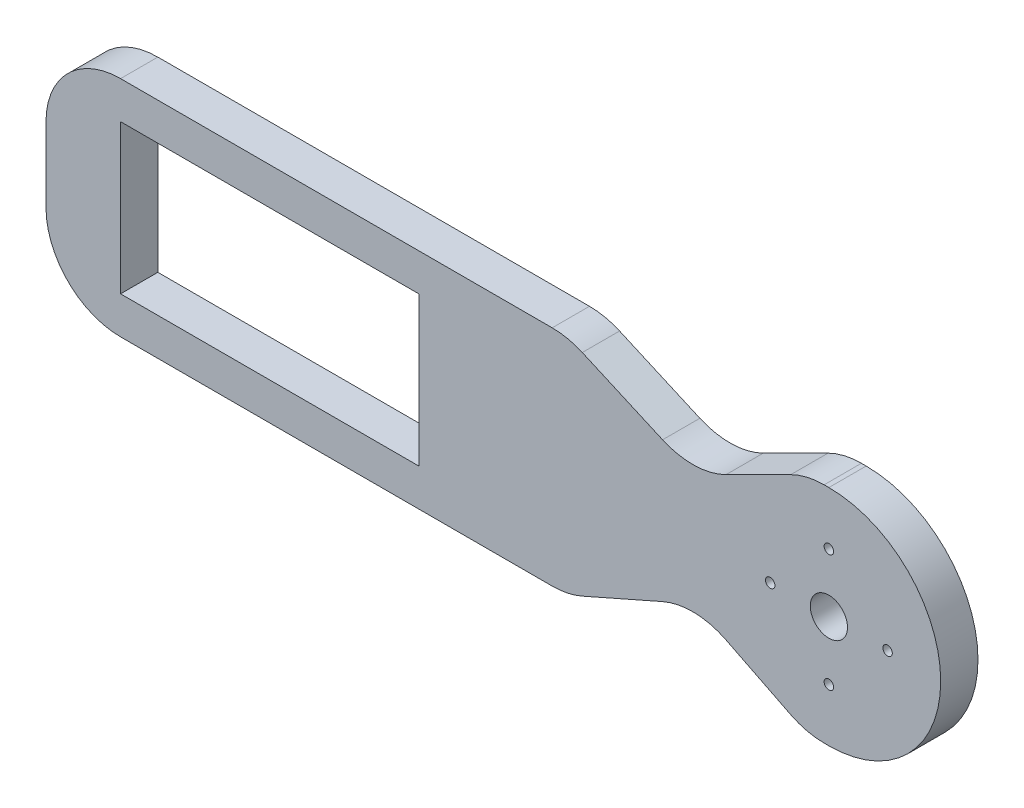
ISO-10303-21;
HEADER;
FILE_DESCRIPTION(('STEP AP214'),'2;1');
FILE_NAME('part.step','',(''),(''),'','','');
FILE_SCHEMA(('AUTOMOTIVE_DESIGN { 1 0 10303 214 1 1 1 1 }'));
ENDSEC;
DATA;
#1=APPLICATION_CONTEXT('core data for automotive mechanical design processes');
#2=APPLICATION_PROTOCOL_DEFINITION('international standard','automotive_design',2000,#1);
#3=PRODUCT_CONTEXT('',#1,'mechanical');
#4=PRODUCT('Part','Part','',(#3));
#5=PRODUCT_RELATED_PRODUCT_CATEGORY('part','',(#4));
#6=PRODUCT_DEFINITION_FORMATION('','',#4);
#7=PRODUCT_DEFINITION_CONTEXT('part definition',#1,'design');
#8=PRODUCT_DEFINITION('design','',#6,#7);
#9=PRODUCT_DEFINITION_SHAPE('','',#8);
#10=(LENGTH_UNIT() NAMED_UNIT(*) SI_UNIT(.MILLI.,.METRE.));
#11=(NAMED_UNIT(*) PLANE_ANGLE_UNIT() SI_UNIT($,.RADIAN.));
#12=(NAMED_UNIT(*) SI_UNIT($,.STERADIAN.) SOLID_ANGLE_UNIT());
#13=UNCERTAINTY_MEASURE_WITH_UNIT(LENGTH_MEASURE(1.E-05),#10,'distance_accuracy_value','');
#14=(GEOMETRIC_REPRESENTATION_CONTEXT(3) GLOBAL_UNCERTAINTY_ASSIGNED_CONTEXT((#13)) GLOBAL_UNIT_ASSIGNED_CONTEXT((#10,
#11,#12)) REPRESENTATION_CONTEXT('',''));
#15=CARTESIAN_POINT('',(0.,0.,0.));
#16=DIRECTION('',(0.,0.,1.));
#17=DIRECTION('',(1.,0.,0.));
#18=AXIS2_PLACEMENT_3D('',#15,#16,#17);
#19=CARTESIAN_POINT('',(-90.,9.9579435379429,5.));
#20=DIRECTION('',(0.,0.,1.));
#21=DIRECTION('',(1.,0.,0.));
#22=AXIS2_PLACEMENT_3D('',#19,#20,#21);
#23=CYLINDRICAL_SURFACE('',#22,10.);
#24=DIRECTION('',(0.,0.,1.));
#25=VECTOR('',#24,1.);
#26=CARTESIAN_POINT('',(-100.,9.9579435379429,5.));
#27=LINE('',#26,#25);
#28=CARTESIAN_POINT('',(-100.,9.9579435379429,0.));
#29=VERTEX_POINT('',#28);
#30=CARTESIAN_POINT('',(-100.,9.9579435379429,5.));
#31=VERTEX_POINT('',#30);
#32=EDGE_CURVE('E450',#29,#31,#27,.T.);
#33=ORIENTED_EDGE('',*,*,#32,.F.);
#34=CARTESIAN_POINT('',(-90.,9.9579435379429,0.));
#35=DIRECTION('',(0.,0.,1.));
#36=DIRECTION('',(1.,0.,0.));
#37=AXIS2_PLACEMENT_3D('',#34,#35,#36);
#38=CIRCLE('',#37,10.);
#39=CARTESIAN_POINT('',(-90.,-0.0420564620571007,0.));
#40=VERTEX_POINT('',#39);
#41=EDGE_CURVE('E47',#40,#29,#38,.F.);
#42=ORIENTED_EDGE('',*,*,#41,.F.);
#43=DIRECTION('',(0.,0.,1.));
#44=VECTOR('',#43,1.);
#45=CARTESIAN_POINT('',(-90.,-0.0420564620571007,5.));
#46=LINE('',#45,#44);
#47=CARTESIAN_POINT('',(-90.,-0.0420564620571007,5.));
#48=VERTEX_POINT('',#47);
#49=EDGE_CURVE('E454',#48,#40,#46,.F.);
#50=ORIENTED_EDGE('',*,*,#49,.F.);
#51=CARTESIAN_POINT('',(-90.,9.9579435379429,5.));
#52=DIRECTION('',(0.,0.,1.));
#53=DIRECTION('',(1.,0.,0.));
#54=AXIS2_PLACEMENT_3D('',#51,#52,#53);
#55=CIRCLE('',#54,10.);
#56=EDGE_CURVE('E11',#31,#48,#55,.T.);
#57=ORIENTED_EDGE('',*,*,#56,.F.);
#58=EDGE_LOOP('',(#33,#42,#50,#57));
#59=FACE_BOUND('',#58,.T.);
#60=ADVANCED_FACE('F39',(#59),#23,.T.);
#61=CARTESIAN_POINT('',(-90.,19.9579435379429,5.));
#62=DIRECTION('',(0.,0.,1.));
#63=DIRECTION('',(1.,0.,0.));
#64=AXIS2_PLACEMENT_3D('',#61,#62,#63);
#65=CYLINDRICAL_SURFACE('',#64,10.);
#66=DIRECTION('',(0.,0.,1.));
#67=VECTOR('',#66,1.);
#68=CARTESIAN_POINT('',(-90.,29.9579435379429,5.));
#69=LINE('',#68,#67);
#70=CARTESIAN_POINT('',(-90.,29.9579435379429,0.));
#71=VERTEX_POINT('',#70);
#72=CARTESIAN_POINT('',(-90.,29.9579435379429,5.));
#73=VERTEX_POINT('',#72);
#74=EDGE_CURVE('E436',#71,#73,#69,.T.);
#75=ORIENTED_EDGE('',*,*,#74,.F.);
#76=CARTESIAN_POINT('',(-90.,19.9579435379429,0.));
#77=DIRECTION('',(0.,0.,1.));
#78=DIRECTION('',(1.,0.,0.));
#79=AXIS2_PLACEMENT_3D('',#76,#77,#78);
#80=CIRCLE('',#79,10.);
#81=CARTESIAN_POINT('',(-100.,19.9579435379429,0.));
#82=VERTEX_POINT('',#81);
#83=EDGE_CURVE('E444',#82,#71,#80,.F.);
#84=ORIENTED_EDGE('',*,*,#83,.F.);
#85=DIRECTION('',(0.,0.,1.));
#86=VECTOR('',#85,1.);
#87=CARTESIAN_POINT('',(-100.,19.9579435379429,5.));
#88=LINE('',#87,#86);
#89=CARTESIAN_POINT('',(-100.,19.9579435379429,5.));
#90=VERTEX_POINT('',#89);
#91=EDGE_CURVE('E440',#90,#82,#88,.F.);
#92=ORIENTED_EDGE('',*,*,#91,.F.);
#93=CARTESIAN_POINT('',(-90.,19.9579435379429,5.));
#94=DIRECTION('',(0.,0.,1.));
#95=DIRECTION('',(1.,0.,0.));
#96=AXIS2_PLACEMENT_3D('',#93,#94,#95);
#97=CIRCLE('',#96,10.);
#98=EDGE_CURVE('E447',#73,#90,#97,.T.);
#99=ORIENTED_EDGE('',*,*,#98,.F.);
#100=EDGE_LOOP('',(#75,#84,#92,#99));
#101=FACE_BOUND('',#100,.T.);
#102=ADVANCED_FACE('F464',(#101),#65,.T.);
#103=CARTESIAN_POINT('',(4.99999999999999,-0.042056462057084,5.));
#104=DIRECTION('',(0.,1.,0.));
#105=DIRECTION('',(-1.,0.,0.));
#106=AXIS2_PLACEMENT_3D('',#103,#104,#105);
#107=PLANE('',#106);
#108=DIRECTION('',(1.,0.,0.));
#109=VECTOR('',#108,1.);
#110=CARTESIAN_POINT('',(4.99999999999999,-0.042056462057084,5.));
#111=LINE('',#110,#109);
#112=CARTESIAN_POINT('',(-32.1078722347494,-0.0420564620570905,5.));
#113=VERTEX_POINT('',#112);
#114=EDGE_CURVE('E403',#48,#113,#111,.T.);
#115=ORIENTED_EDGE('',*,*,#114,.F.);
#116=ORIENTED_EDGE('',*,*,#49,.T.);
#117=DIRECTION('',(1.,0.,0.));
#118=VECTOR('',#117,1.);
#119=CARTESIAN_POINT('',(4.99999999999999,-0.042056462057084,0.));
#120=LINE('',#119,#118);
#121=CARTESIAN_POINT('',(-32.1078722347494,-0.0420564620571035,0.));
#122=VERTEX_POINT('',#121);
#123=EDGE_CURVE('E419',#40,#122,#120,.T.);
#124=ORIENTED_EDGE('',*,*,#123,.T.);
#125=DIRECTION('',(0.,0.,1.));
#126=VECTOR('',#125,1.);
#127=CARTESIAN_POINT('',(-32.1078722347494,-0.0420564620571035,0.));
#128=LINE('',#127,#126);
#129=EDGE_CURVE('E306',#122,#113,#128,.T.);
#130=ORIENTED_EDGE('',*,*,#129,.T.);
#131=EDGE_LOOP('',(#115,#116,#124,#130));
#132=FACE_BOUND('',#131,.T.);
#133=ADVANCED_FACE('F516',(#132),#107,.F.);
#134=CARTESIAN_POINT('',(4.99999999999999,29.9579435379429,5.));
#135=DIRECTION('',(0.,-1.,0.));
#136=DIRECTION('',(1.,0.,0.));
#137=AXIS2_PLACEMENT_3D('',#134,#135,#136);
#138=PLANE('',#137);
#139=DIRECTION('',(0.,0.,1.));
#140=VECTOR('',#139,1.);
#141=CARTESIAN_POINT('',(4.36067977499791,29.9579435379429,0.));
#142=LINE('',#141,#140);
#143=CARTESIAN_POINT('',(4.36067977499791,29.9579435379429,0.));
#144=VERTEX_POINT('',#143);
#145=CARTESIAN_POINT('',(4.36067977499791,29.9579435379429,5.));
#146=VERTEX_POINT('',#145);
#147=EDGE_CURVE('E251',#144,#146,#142,.T.);
#148=ORIENTED_EDGE('',*,*,#147,.T.);
#149=DIRECTION('',(-1.,0.,0.));
#150=VECTOR('',#149,1.);
#151=CARTESIAN_POINT('',(4.99999999999999,29.9579435379429,5.));
#152=LINE('',#151,#150);
#153=CARTESIAN_POINT('',(4.99999999999999,29.9579435379429,5.));
#154=VERTEX_POINT('',#153);
#155=EDGE_CURVE('E410',#154,#146,#152,.T.);
#156=ORIENTED_EDGE('',*,*,#155,.F.);
#157=DIRECTION('',(0.,0.,-1.));
#158=VECTOR('',#157,1.);
#159=CARTESIAN_POINT('',(4.99999999999999,29.9579435379429,5.));
#160=LINE('',#159,#158);
#161=CARTESIAN_POINT('',(4.99999999999999,29.9579435379429,0.));
#162=VERTEX_POINT('',#161);
#163=EDGE_CURVE('E414',#154,#162,#160,.T.);
#164=ORIENTED_EDGE('',*,*,#163,.T.);
#165=DIRECTION('',(-1.,0.,0.));
#166=VECTOR('',#165,1.);
#167=CARTESIAN_POINT('',(4.99999999999999,29.9579435379429,0.));
#168=LINE('',#167,#166);
#169=EDGE_CURVE('E402',#162,#144,#168,.T.);
#170=ORIENTED_EDGE('',*,*,#169,.T.);
#171=EDGE_LOOP('',(#148,#156,#164,#170));
#172=FACE_BOUND('',#171,.T.);
#173=ADVANCED_FACE('F484',(#172),#138,.F.);
#174=CARTESIAN_POINT('',(4.99999999999999,14.9579435379429,5.));
#175=DIRECTION('',(0.,0.,1.));
#176=DIRECTION('',(1.,0.,0.));
#177=AXIS2_PLACEMENT_3D('',#174,#175,#176);
#178=PLANE('',#177);
#179=DIRECTION('',(0.,-1.,0.));
#180=VECTOR('',#179,1.);
#181=CARTESIAN_POINT('',(-100.,-0.0420564620571024,5.));
#182=LINE('',#181,#180);
#183=EDGE_CURVE('E398',#90,#31,#182,.T.);
#184=ORIENTED_EDGE('',*,*,#183,.T.);
#185=ORIENTED_EDGE('',*,*,#56,.T.);
#186=ORIENTED_EDGE('',*,*,#114,.T.);
#187=CARTESIAN_POINT('',(-32.1078722347494,9.9579435379429,5.));
#188=DIRECTION('',(0.,0.,-1.));
#189=DIRECTION('',(-1.,0.,0.));
#190=AXIS2_PLACEMENT_3D('',#187,#188,#189);
#191=CIRCLE('',#190,10.);
#192=CARTESIAN_POINT('',(-28.0714701689865,0.808765522213577,5.));
#193=VERTEX_POINT('',#192);
#194=EDGE_CURVE('E287',#193,#113,#191,.T.);
#195=ORIENTED_EDGE('',*,*,#194,.F.);
#196=DIRECTION('',(-0.914917801572932,-0.403640206576293,0.));
#197=VECTOR('',#196,1.);
#198=CARTESIAN_POINT('',(-28.0714701689865,0.808765522213579,5.));
#199=LINE('',#198,#197);
#200=CARTESIAN_POINT('',(-17.3024480861918,5.55980467638769,5.));
#201=VERTEX_POINT('',#200);
#202=EDGE_CURVE('E283',#201,#193,#199,.T.);
#203=ORIENTED_EDGE('',*,*,#202,.F.);
#204=CARTESIAN_POINT('',(-13.2660460204289,-3.58937333934163,5.));
#205=DIRECTION('',(0.,0.,1.));
#206=DIRECTION('',(1.,0.,0.));
#207=AXIS2_PLACEMENT_3D('',#204,#205,#206);
#208=CIRCLE('',#207,9.99999999999999);
#209=CARTESIAN_POINT('',(-8.79391006542929,5.35489857065753,5.));
#210=VERTEX_POINT('',#209);
#211=EDGE_CURVE('E279',#210,#201,#208,.T.);
#212=ORIENTED_EDGE('',*,*,#211,.F.);
#213=DIRECTION('',(-0.894427190999916,0.447213595499958,0.));
#214=VECTOR('',#213,1.);
#215=CARTESIAN_POINT('',(-8.79391006542929,5.35489857065753,5.));
#216=LINE('',#215,#214);
#217=CARTESIAN_POINT('',(-0.111456180001714,1.01367162794374,5.));
#218=VERTEX_POINT('',#217);
#219=EDGE_CURVE('E262',#218,#210,#216,.T.);
#220=ORIENTED_EDGE('',*,*,#219,.F.);
#221=CARTESIAN_POINT('',(4.36067977499787,9.9579435379429,5.));
#222=DIRECTION('',(0.,0.,-1.));
#223=DIRECTION('',(-1.,0.,0.));
#224=AXIS2_PLACEMENT_3D('',#221,#222,#223);
#225=CIRCLE('',#224,10.);
#226=CARTESIAN_POINT('',(4.36067977499792,-0.042056462057103,5.));
#227=VERTEX_POINT('',#226);
#228=EDGE_CURVE('E291',#227,#218,#225,.T.);
#229=ORIENTED_EDGE('',*,*,#228,.F.);
#230=CARTESIAN_POINT('',(4.99999999999999,-0.0420564620570805,5.));
#231=VERTEX_POINT('',#230);
#232=EDGE_CURVE('E401',#227,#231,#111,.T.);
#233=ORIENTED_EDGE('',*,*,#232,.T.);
#234=CARTESIAN_POINT('',(4.99999999999999,14.9579435379429,5.));
#235=DIRECTION('',(0.,0.,1.));
#236=DIRECTION('',(1.,0.,0.));
#237=AXIS2_PLACEMENT_3D('',#234,#235,#236);
#238=CIRCLE('',#237,15.);
#239=EDGE_CURVE('E406',#231,#154,#238,.T.);
#240=ORIENTED_EDGE('',*,*,#239,.T.);
#241=ORIENTED_EDGE('',*,*,#155,.T.);
#242=CARTESIAN_POINT('',(4.36067977499787,19.9579435379429,5.));
#243=DIRECTION('',(0.,0.,-1.));
#244=DIRECTION('',(1.,0.,0.));
#245=AXIS2_PLACEMENT_3D('',#242,#243,#244);
#246=CIRCLE('',#245,10.);
#247=CARTESIAN_POINT('',(-0.111456180001707,28.9022154479421,5.));
#248=VERTEX_POINT('',#247);
#249=EDGE_CURVE('E235',#248,#146,#246,.T.);
#250=ORIENTED_EDGE('',*,*,#249,.F.);
#251=DIRECTION('',(0.894427190999916,0.447213595499958,0.));
#252=VECTOR('',#251,1.);
#253=CARTESIAN_POINT('',(-8.79391006542929,24.5609885052283,5.));
#254=LINE('',#253,#252);
#255=CARTESIAN_POINT('',(-8.79391006542929,24.5609885052283,5.));
#256=VERTEX_POINT('',#255);
#257=EDGE_CURVE('E231',#256,#248,#254,.T.);
#258=ORIENTED_EDGE('',*,*,#257,.F.);
#259=CARTESIAN_POINT('',(-13.2660460204289,33.5052604152274,5.));
#260=DIRECTION('',(0.,0.,1.));
#261=DIRECTION('',(-1.,0.,0.));
#262=AXIS2_PLACEMENT_3D('',#259,#260,#261);
#263=CIRCLE('',#262,9.99999999999999);
#264=CARTESIAN_POINT('',(-17.3024480861918,24.3560823994981,5.));
#265=VERTEX_POINT('',#264);
#266=EDGE_CURVE('E192',#265,#256,#263,.T.);
#267=ORIENTED_EDGE('',*,*,#266,.F.);
#268=DIRECTION('',(0.914917801572932,-0.403640206576293,0.));
#269=VECTOR('',#268,1.);
#270=CARTESIAN_POINT('',(-28.0714701689865,29.1071215536722,5.));
#271=LINE('',#270,#269);
#272=CARTESIAN_POINT('',(-28.0714701689865,29.1071215536722,5.));
#273=VERTEX_POINT('',#272);
#274=EDGE_CURVE('E215',#273,#265,#271,.T.);
#275=ORIENTED_EDGE('',*,*,#274,.F.);
#276=CARTESIAN_POINT('',(-32.1078722347494,19.9579435379429,5.));
#277=DIRECTION('',(0.,0.,-1.));
#278=DIRECTION('',(1.,0.,0.));
#279=AXIS2_PLACEMENT_3D('',#276,#277,#278);
#280=CIRCLE('',#279,10.);
#281=CARTESIAN_POINT('',(-32.1078722347494,29.9579435379429,5.));
#282=VERTEX_POINT('',#281);
#283=EDGE_CURVE('E219',#282,#273,#280,.T.);
#284=ORIENTED_EDGE('',*,*,#283,.F.);
#285=EDGE_CURVE('E409',#282,#73,#152,.T.);
#286=ORIENTED_EDGE('',*,*,#285,.T.);
#287=ORIENTED_EDGE('',*,*,#98,.T.);
#288=EDGE_LOOP('',(#184,#185,#186,#195,#203,#212,#220,#229,#233,#240,#241,#250,#258,#267,#275,
#284,#286,#287));
#289=FACE_BOUND('',#288,.T.);
#290=CARTESIAN_POINT('',(12.8750033,14.9579435379429,5.));
#291=DIRECTION('',(0.,0.,1.));
#292=DIRECTION('',(1.,0.,0.));
#293=AXIS2_PLACEMENT_3D('',#290,#291,#292);
#294=CIRCLE('',#293,0.635000000000001);
#295=CARTESIAN_POINT('',(13.5100033,14.9579435379429,5.));
#296=VERTEX_POINT('',#295);
#297=EDGE_CURVE('E323',#296,#296,#294,.T.);
#298=ORIENTED_EDGE('',*,*,#297,.F.);
#299=EDGE_LOOP('',(#298));
#300=FACE_BOUND('',#299,.T.);
#301=DIRECTION('',(1.,0.,0.));
#302=VECTOR('',#301,1.);
#303=CARTESIAN_POINT('',(-90.,4.9579435379429,5.));
#304=LINE('',#303,#302);
#305=CARTESIAN_POINT('',(-90.,4.9579435379429,5.));
#306=VERTEX_POINT('',#305);
#307=CARTESIAN_POINT('',(-50.,4.9579435379429,5.));
#308=VERTEX_POINT('',#307);
#309=EDGE_CURVE('E342',#306,#308,#304,.T.);
#310=ORIENTED_EDGE('',*,*,#309,.F.);
#311=DIRECTION('',(0.,-1.,0.));
#312=VECTOR('',#311,1.);
#313=CARTESIAN_POINT('',(-90.,24.9579435379429,5.));
#314=LINE('',#313,#312);
#315=CARTESIAN_POINT('',(-90.,24.9579435379429,5.));
#316=VERTEX_POINT('',#315);
#317=EDGE_CURVE('E339',#316,#306,#314,.T.);
#318=ORIENTED_EDGE('',*,*,#317,.F.);
#319=DIRECTION('',(-1.,0.,0.));
#320=VECTOR('',#319,1.);
#321=CARTESIAN_POINT('',(-90.,24.9579435379429,5.));
#322=LINE('',#321,#320);
#323=CARTESIAN_POINT('',(-50.,24.9579435379429,5.));
#324=VERTEX_POINT('',#323);
#325=EDGE_CURVE('E350',#324,#316,#322,.T.);
#326=ORIENTED_EDGE('',*,*,#325,.F.);
#327=DIRECTION('',(0.,1.,0.));
#328=VECTOR('',#327,1.);
#329=CARTESIAN_POINT('',(-50.,24.9579435379429,5.));
#330=LINE('',#329,#328);
#331=EDGE_CURVE('E346',#308,#324,#330,.T.);
#332=ORIENTED_EDGE('',*,*,#331,.F.);
#333=EDGE_LOOP('',(#310,#318,#326,#332));
#334=FACE_BOUND('',#333,.T.);
#335=CARTESIAN_POINT('',(4.99999999999999,22.8329468379429,5.));
#336=DIRECTION('',(0.,0.,1.));
#337=DIRECTION('',(1.,0.,0.));
#338=AXIS2_PLACEMENT_3D('',#335,#336,#337);
#339=CIRCLE('',#338,0.635);
#340=CARTESIAN_POINT('',(5.63499999999999,22.8329468379429,5.));
#341=VERTEX_POINT('',#340);
#342=EDGE_CURVE('E382',#341,#341,#339,.T.);
#343=ORIENTED_EDGE('',*,*,#342,.F.);
#344=EDGE_LOOP('',(#343));
#345=FACE_BOUND('',#344,.T.);
#346=CARTESIAN_POINT('',(4.99999999999999,14.9579435379429,5.));
#347=DIRECTION('',(0.,0.,1.));
#348=DIRECTION('',(1.,0.,0.));
#349=AXIS2_PLACEMENT_3D('',#346,#347,#348);
#350=CIRCLE('',#349,2.5);
#351=CARTESIAN_POINT('',(7.49999999999999,14.9579435379429,5.));
#352=VERTEX_POINT('',#351);
#353=EDGE_CURVE('E390',#352,#352,#350,.T.);
#354=ORIENTED_EDGE('',*,*,#353,.F.);
#355=EDGE_LOOP('',(#354));
#356=FACE_BOUND('',#355,.T.);
#357=CARTESIAN_POINT('',(-2.87500330000001,14.9579435379429,5.));
#358=DIRECTION('',(0.,0.,1.));
#359=DIRECTION('',(1.,0.,0.));
#360=AXIS2_PLACEMENT_3D('',#357,#358,#359);
#361=CIRCLE('',#360,0.634999999999999);
#362=CARTESIAN_POINT('',(-2.24000330000001,14.9579435379429,5.));
#363=VERTEX_POINT('',#362);
#364=EDGE_CURVE('E331',#363,#363,#361,.T.);
#365=ORIENTED_EDGE('',*,*,#364,.F.);
#366=EDGE_LOOP('',(#365));
#367=FACE_BOUND('',#366,.T.);
#368=CARTESIAN_POINT('',(4.99999999999999,7.08294023794292,5.));
#369=DIRECTION('',(0.,0.,1.));
#370=DIRECTION('',(1.,0.,0.));
#371=AXIS2_PLACEMENT_3D('',#368,#369,#370);
#372=CIRCLE('',#371,0.635000000000001);
#373=CARTESIAN_POINT('',(5.63499999999999,7.08294023794292,5.));
#374=VERTEX_POINT('',#373);
#375=EDGE_CURVE('E315',#374,#374,#372,.T.);
#376=ORIENTED_EDGE('',*,*,#375,.F.);
#377=EDGE_LOOP('',(#376));
#378=FACE_BOUND('',#377,.T.);
#379=ADVANCED_FACE('F487',(#289,#300,#334,#345,#356,#367,#378),#178,.T.);
#380=CARTESIAN_POINT('',(4.99999999999999,14.9579435379429,0.));
#381=DIRECTION('',(0.,0.,1.));
#382=DIRECTION('',(1.,0.,0.));
#383=AXIS2_PLACEMENT_3D('',#380,#381,#382);
#384=PLANE('',#383);
#385=ORIENTED_EDGE('',*,*,#123,.F.);
#386=ORIENTED_EDGE('',*,*,#41,.T.);
#387=DIRECTION('',(0.,-1.,0.));
#388=VECTOR('',#387,1.);
#389=CARTESIAN_POINT('',(-100.,-0.0420564620571024,0.));
#390=LINE('',#389,#388);
#391=EDGE_CURVE('E394',#82,#29,#390,.T.);
#392=ORIENTED_EDGE('',*,*,#391,.F.);
#393=ORIENTED_EDGE('',*,*,#83,.T.);
#394=CARTESIAN_POINT('',(-32.1078722347494,29.9579435379429,0.));
#395=VERTEX_POINT('',#394);
#396=EDGE_CURVE('E425',#395,#71,#168,.T.);
#397=ORIENTED_EDGE('',*,*,#396,.F.);
#398=CARTESIAN_POINT('',(-32.1078722347494,19.9579435379429,0.));
#399=DIRECTION('',(0.,0.,-1.));
#400=DIRECTION('',(1.,0.,0.));
#401=AXIS2_PLACEMENT_3D('',#398,#399,#400);
#402=CIRCLE('',#401,10.);
#403=CARTESIAN_POINT('',(-28.0714701689865,29.1071215536722,0.));
#404=VERTEX_POINT('',#403);
#405=EDGE_CURVE('E224',#395,#404,#402,.T.);
#406=ORIENTED_EDGE('',*,*,#405,.T.);
#407=DIRECTION('',(0.914917801572932,-0.403640206576293,0.));
#408=VECTOR('',#407,1.);
#409=CARTESIAN_POINT('',(-28.0714701689865,29.1071215536722,0.));
#410=LINE('',#409,#408);
#411=CARTESIAN_POINT('',(-17.3024480861918,24.3560823994981,0.));
#412=VERTEX_POINT('',#411);
#413=EDGE_CURVE('E198',#404,#412,#410,.T.);
#414=ORIENTED_EDGE('',*,*,#413,.T.);
#415=CARTESIAN_POINT('',(-13.2660460204289,33.5052604152274,0.));
#416=DIRECTION('',(0.,0.,1.));
#417=DIRECTION('',(-1.,0.,0.));
#418=AXIS2_PLACEMENT_3D('',#415,#416,#417);
#419=CIRCLE('',#418,9.99999999999999);
#420=CARTESIAN_POINT('',(-8.79391006542929,24.5609885052283,0.));
#421=VERTEX_POINT('',#420);
#422=EDGE_CURVE('E189',#412,#421,#419,.T.);
#423=ORIENTED_EDGE('',*,*,#422,.T.);
#424=DIRECTION('',(0.894427190999916,0.447213595499958,0.));
#425=VECTOR('',#424,1.);
#426=CARTESIAN_POINT('',(-8.79391006542929,24.5609885052283,0.));
#427=LINE('',#426,#425);
#428=CARTESIAN_POINT('',(-0.111456180001707,28.9022154479421,0.));
#429=VERTEX_POINT('',#428);
#430=EDGE_CURVE('E201',#421,#429,#427,.T.);
#431=ORIENTED_EDGE('',*,*,#430,.T.);
#432=CARTESIAN_POINT('',(4.36067977499787,19.9579435379429,0.));
#433=DIRECTION('',(0.,0.,-1.));
#434=DIRECTION('',(1.,0.,0.));
#435=AXIS2_PLACEMENT_3D('',#432,#433,#434);
#436=CIRCLE('',#435,10.);
#437=EDGE_CURVE('E207',#429,#144,#436,.T.);
#438=ORIENTED_EDGE('',*,*,#437,.T.);
#439=ORIENTED_EDGE('',*,*,#169,.F.);
#440=CARTESIAN_POINT('',(4.99999999999999,14.9579435379429,0.));
#441=DIRECTION('',(0.,0.,1.));
#442=DIRECTION('',(1.,0.,0.));
#443=AXIS2_PLACEMENT_3D('',#440,#441,#442);
#444=CIRCLE('',#443,15.);
#445=CARTESIAN_POINT('',(4.99999999999999,-0.0420564620570805,0.));
#446=VERTEX_POINT('',#445);
#447=EDGE_CURVE('E422',#446,#162,#444,.T.);
#448=ORIENTED_EDGE('',*,*,#447,.F.);
#449=CARTESIAN_POINT('',(4.36067977499792,-0.042056462057103,0.));
#450=VERTEX_POINT('',#449);
#451=EDGE_CURVE('E418',#450,#446,#120,.T.);
#452=ORIENTED_EDGE('',*,*,#451,.F.);
#453=CARTESIAN_POINT('',(4.36067977499787,9.9579435379429,0.));
#454=DIRECTION('',(0.,0.,-1.));
#455=DIRECTION('',(-1.,0.,0.));
#456=AXIS2_PLACEMENT_3D('',#453,#454,#455);
#457=CIRCLE('',#456,10.);
#458=CARTESIAN_POINT('',(-0.111456180001714,1.01367162794374,0.));
#459=VERTEX_POINT('',#458);
#460=EDGE_CURVE('E270',#450,#459,#457,.T.);
#461=ORIENTED_EDGE('',*,*,#460,.T.);
#462=DIRECTION('',(-0.894427190999916,0.447213595499958,0.));
#463=VECTOR('',#462,1.);
#464=CARTESIAN_POINT('',(-8.79391006542929,5.35489857065753,0.));
#465=LINE('',#464,#463);
#466=CARTESIAN_POINT('',(-8.79391006542929,5.35489857065753,0.));
#467=VERTEX_POINT('',#466);
#468=EDGE_CURVE('E274',#459,#467,#465,.T.);
#469=ORIENTED_EDGE('',*,*,#468,.T.);
#470=CARTESIAN_POINT('',(-13.2660460204289,-3.58937333934163,0.));
#471=DIRECTION('',(0.,0.,1.));
#472=DIRECTION('',(1.,0.,0.));
#473=AXIS2_PLACEMENT_3D('',#470,#471,#472);
#474=CIRCLE('',#473,9.99999999999999);
#475=CARTESIAN_POINT('',(-17.3024480861918,5.55980467638769,0.));
#476=VERTEX_POINT('',#475);
#477=EDGE_CURVE('E257',#467,#476,#474,.T.);
#478=ORIENTED_EDGE('',*,*,#477,.T.);
#479=DIRECTION('',(-0.914917801572932,-0.403640206576293,0.));
#480=VECTOR('',#479,1.);
#481=CARTESIAN_POINT('',(-28.0714701689865,0.808765522213579,0.));
#482=LINE('',#481,#480);
#483=CARTESIAN_POINT('',(-28.0714701689865,0.808765522213577,0.));
#484=VERTEX_POINT('',#483);
#485=EDGE_CURVE('E261',#476,#484,#482,.T.);
#486=ORIENTED_EDGE('',*,*,#485,.T.);
#487=CARTESIAN_POINT('',(-32.1078722347494,9.9579435379429,0.));
#488=DIRECTION('',(0.,0.,-1.));
#489=DIRECTION('',(-1.,0.,0.));
#490=AXIS2_PLACEMENT_3D('',#487,#488,#489);
#491=CIRCLE('',#490,10.);
#492=EDGE_CURVE('E266',#484,#122,#491,.T.);
#493=ORIENTED_EDGE('',*,*,#492,.T.);
#494=EDGE_LOOP('',(#385,#386,#392,#393,#397,#406,#414,#423,#431,#438,#439,#448,#452,#461,#469,
#478,#486,#493));
#495=FACE_BOUND('',#494,.T.);
#496=CARTESIAN_POINT('',(4.99999999999999,22.8329468379429,0.));
#497=DIRECTION('',(0.,0.,1.));
#498=DIRECTION('',(1.,0.,0.));
#499=AXIS2_PLACEMENT_3D('',#496,#497,#498);
#500=CIRCLE('',#499,0.635);
#501=CARTESIAN_POINT('',(5.63499999999999,22.8329468379429,0.));
#502=VERTEX_POINT('',#501);
#503=EDGE_CURVE('E381',#502,#502,#500,.T.);
#504=ORIENTED_EDGE('',*,*,#503,.T.);
#505=EDGE_LOOP('',(#504));
#506=FACE_BOUND('',#505,.T.);
#507=CARTESIAN_POINT('',(4.99999999999999,14.9579435379429,0.));
#508=DIRECTION('',(0.,0.,1.));
#509=DIRECTION('',(1.,0.,0.));
#510=AXIS2_PLACEMENT_3D('',#507,#508,#509);
#511=CIRCLE('',#510,2.5);
#512=CARTESIAN_POINT('',(7.49999999999999,14.9579435379429,0.));
#513=VERTEX_POINT('',#512);
#514=EDGE_CURVE('E386',#513,#513,#511,.T.);
#515=ORIENTED_EDGE('',*,*,#514,.T.);
#516=EDGE_LOOP('',(#515));
#517=FACE_BOUND('',#516,.T.);
#518=DIRECTION('',(0.,-1.,0.));
#519=VECTOR('',#518,1.);
#520=CARTESIAN_POINT('',(-90.,24.9579435379429,0.));
#521=LINE('',#520,#519);
#522=CARTESIAN_POINT('',(-90.,24.9579435379429,0.));
#523=VERTEX_POINT('',#522);
#524=CARTESIAN_POINT('',(-90.,4.9579435379429,0.));
#525=VERTEX_POINT('',#524);
#526=EDGE_CURVE('E335',#523,#525,#521,.T.);
#527=ORIENTED_EDGE('',*,*,#526,.T.);
#528=DIRECTION('',(1.,0.,0.));
#529=VECTOR('',#528,1.);
#530=CARTESIAN_POINT('',(-90.,4.9579435379429,0.));
#531=LINE('',#530,#529);
#532=CARTESIAN_POINT('',(-50.,4.9579435379429,0.));
#533=VERTEX_POINT('',#532);
#534=EDGE_CURVE('E357',#525,#533,#531,.T.);
#535=ORIENTED_EDGE('',*,*,#534,.T.);
#536=DIRECTION('',(0.,1.,0.));
#537=VECTOR('',#536,1.);
#538=CARTESIAN_POINT('',(-50.,24.9579435379429,0.));
#539=LINE('',#538,#537);
#540=CARTESIAN_POINT('',(-50.,24.9579435379429,0.));
#541=VERTEX_POINT('',#540);
#542=EDGE_CURVE('E361',#533,#541,#539,.T.);
#543=ORIENTED_EDGE('',*,*,#542,.T.);
#544=DIRECTION('',(-1.,0.,0.));
#545=VECTOR('',#544,1.);
#546=CARTESIAN_POINT('',(-90.,24.9579435379429,0.));
#547=LINE('',#546,#545);
#548=EDGE_CURVE('E343',#541,#523,#547,.T.);
#549=ORIENTED_EDGE('',*,*,#548,.T.);
#550=EDGE_LOOP('',(#527,#535,#543,#549));
#551=FACE_BOUND('',#550,.T.);
#552=CARTESIAN_POINT('',(-2.87500330000001,14.9579435379429,0.));
#553=DIRECTION('',(0.,0.,1.));
#554=DIRECTION('',(1.,0.,0.));
#555=AXIS2_PLACEMENT_3D('',#552,#553,#554);
#556=CIRCLE('',#555,0.634999999999999);
#557=CARTESIAN_POINT('',(-2.24000330000001,14.9579435379429,0.));
#558=VERTEX_POINT('',#557);
#559=EDGE_CURVE('E327',#558,#558,#556,.T.);
#560=ORIENTED_EDGE('',*,*,#559,.T.);
#561=EDGE_LOOP('',(#560));
#562=FACE_BOUND('',#561,.T.);
#563=CARTESIAN_POINT('',(12.8750033,14.9579435379429,0.));
#564=DIRECTION('',(0.,0.,1.));
#565=DIRECTION('',(1.,0.,0.));
#566=AXIS2_PLACEMENT_3D('',#563,#564,#565);
#567=CIRCLE('',#566,0.635000000000001);
#568=CARTESIAN_POINT('',(13.5100033,14.9579435379429,0.));
#569=VERTEX_POINT('',#568);
#570=EDGE_CURVE('E319',#569,#569,#567,.T.);
#571=ORIENTED_EDGE('',*,*,#570,.T.);
#572=EDGE_LOOP('',(#571));
#573=FACE_BOUND('',#572,.T.);
#574=CARTESIAN_POINT('',(4.99999999999999,7.08294023794292,0.));
#575=DIRECTION('',(0.,0.,1.));
#576=DIRECTION('',(1.,0.,0.));
#577=AXIS2_PLACEMENT_3D('',#574,#575,#576);
#578=CIRCLE('',#577,0.635000000000001);
#579=CARTESIAN_POINT('',(5.63499999999999,7.08294023794292,0.));
#580=VERTEX_POINT('',#579);
#581=EDGE_CURVE('E244',#580,#580,#578,.T.);
#582=ORIENTED_EDGE('',*,*,#581,.T.);
#583=EDGE_LOOP('',(#582));
#584=FACE_BOUND('',#583,.T.);
#585=ADVANCED_FACE('F210',(#495,#506,#517,#551,#562,#573,#584),#384,.F.);
#586=CARTESIAN_POINT('',(-100.,-0.0420564620571024,5.));
#587=DIRECTION('',(1.,0.,0.));
#588=DIRECTION('',(0.,0.,-1.));
#589=AXIS2_PLACEMENT_3D('',#586,#587,#588);
#590=PLANE('',#589);
#591=ORIENTED_EDGE('',*,*,#391,.T.);
#592=ORIENTED_EDGE('',*,*,#32,.T.);
#593=ORIENTED_EDGE('',*,*,#183,.F.);
#594=ORIENTED_EDGE('',*,*,#91,.T.);
#595=EDGE_LOOP('',(#591,#592,#593,#594));
#596=FACE_BOUND('',#595,.T.);
#597=ADVANCED_FACE('F460',(#596),#590,.F.);
#598=ORIENTED_EDGE('',*,*,#232,.F.);
#599=DIRECTION('',(0.,0.,1.));
#600=VECTOR('',#599,1.);
#601=CARTESIAN_POINT('',(4.36067977499792,-0.042056462057103,0.));
#602=LINE('',#601,#600);
#603=EDGE_CURVE('E303',#450,#227,#602,.T.);
#604=ORIENTED_EDGE('',*,*,#603,.F.);
#605=ORIENTED_EDGE('',*,*,#451,.T.);
#606=DIRECTION('',(0.,0.,-1.));
#607=VECTOR('',#606,1.);
#608=CARTESIAN_POINT('',(4.99999999999999,-0.0420564620570805,5.));
#609=LINE('',#608,#607);
#610=EDGE_CURVE('E432',#231,#446,#609,.T.);
#611=ORIENTED_EDGE('',*,*,#610,.F.);
#612=EDGE_LOOP('',(#598,#604,#605,#611));
#613=FACE_BOUND('',#612,.T.);
#614=ADVANCED_FACE('F476',(#613),#107,.F.);
#615=CARTESIAN_POINT('',(4.99999999999999,14.9579435379429,5.));
#616=DIRECTION('',(0.,0.,-1.));
#617=DIRECTION('',(-1.,0.,0.));
#618=AXIS2_PLACEMENT_3D('',#615,#616,#617);
#619=CYLINDRICAL_SURFACE('',#618,15.);
#620=ORIENTED_EDGE('',*,*,#447,.T.);
#621=ORIENTED_EDGE('',*,*,#163,.F.);
#622=ORIENTED_EDGE('',*,*,#239,.F.);
#623=ORIENTED_EDGE('',*,*,#610,.T.);
#624=EDGE_LOOP('',(#620,#621,#622,#623));
#625=FACE_BOUND('',#624,.T.);
#626=ADVANCED_FACE('F480',(#625),#619,.T.);
#627=ORIENTED_EDGE('',*,*,#396,.T.);
#628=ORIENTED_EDGE('',*,*,#74,.T.);
#629=ORIENTED_EDGE('',*,*,#285,.F.);
#630=DIRECTION('',(0.,0.,1.));
#631=VECTOR('',#630,1.);
#632=CARTESIAN_POINT('',(-32.1078722347494,29.9579435379429,0.));
#633=LINE('',#632,#631);
#634=EDGE_CURVE('E248',#395,#282,#633,.T.);
#635=ORIENTED_EDGE('',*,*,#634,.F.);
#636=EDGE_LOOP('',(#627,#628,#629,#635));
#637=FACE_BOUND('',#636,.T.);
#638=ADVANCED_FACE('F497',(#637),#138,.F.);
#639=CARTESIAN_POINT('',(4.99999999999999,14.9579435379429,5.));
#640=DIRECTION('',(0.,0.,-1.));
#641=DIRECTION('',(-1.,0.,0.));
#642=AXIS2_PLACEMENT_3D('',#639,#640,#641);
#643=CYLINDRICAL_SURFACE('',#642,2.5);
#644=ORIENTED_EDGE('',*,*,#353,.T.);
#645=EDGE_LOOP('',(#644));
#646=FACE_BOUND('',#645,.T.);
#647=ORIENTED_EDGE('',*,*,#514,.F.);
#648=EDGE_LOOP('',(#647));
#649=FACE_BOUND('',#648,.T.);
#650=ADVANCED_FACE('F530',(#646,#649),#643,.F.);
#651=CARTESIAN_POINT('',(4.99999999999999,22.8329468379429,5.));
#652=DIRECTION('',(0.,0.,-1.));
#653=DIRECTION('',(-1.,0.,0.));
#654=AXIS2_PLACEMENT_3D('',#651,#652,#653);
#655=CYLINDRICAL_SURFACE('',#654,0.635);
#656=ORIENTED_EDGE('',*,*,#342,.T.);
#657=EDGE_LOOP('',(#656));
#658=FACE_BOUND('',#657,.T.);
#659=ORIENTED_EDGE('',*,*,#503,.F.);
#660=EDGE_LOOP('',(#659));
#661=FACE_BOUND('',#660,.T.);
#662=ADVANCED_FACE('F537',(#658,#661),#655,.F.);
#663=CARTESIAN_POINT('',(-90.,24.9579435379429,5.));
#664=DIRECTION('',(1.,0.,0.));
#665=DIRECTION('',(0.,0.,-1.));
#666=AXIS2_PLACEMENT_3D('',#663,#664,#665);
#667=PLANE('',#666);
#668=ORIENTED_EDGE('',*,*,#526,.F.);
#669=DIRECTION('',(0.,0.,-1.));
#670=VECTOR('',#669,1.);
#671=CARTESIAN_POINT('',(-90.,24.9579435379429,5.));
#672=LINE('',#671,#670);
#673=EDGE_CURVE('E353',#316,#523,#672,.T.);
#674=ORIENTED_EDGE('',*,*,#673,.F.);
#675=ORIENTED_EDGE('',*,*,#317,.T.);
#676=DIRECTION('',(0.,0.,-1.));
#677=VECTOR('',#676,1.);
#678=CARTESIAN_POINT('',(-90.,4.9579435379429,5.));
#679=LINE('',#678,#677);
#680=EDGE_CURVE('E377',#306,#525,#679,.T.);
#681=ORIENTED_EDGE('',*,*,#680,.T.);
#682=EDGE_LOOP('',(#668,#674,#675,#681));
#683=FACE_BOUND('',#682,.T.);
#684=ADVANCED_FACE('F541',(#683),#667,.T.);
#685=CARTESIAN_POINT('',(-90.,4.9579435379429,5.));
#686=DIRECTION('',(0.,1.,0.));
#687=DIRECTION('',(0.,0.,1.));
#688=AXIS2_PLACEMENT_3D('',#685,#686,#687);
#689=PLANE('',#688);
#690=ORIENTED_EDGE('',*,*,#534,.F.);
#691=ORIENTED_EDGE('',*,*,#680,.F.);
#692=ORIENTED_EDGE('',*,*,#309,.T.);
#693=DIRECTION('',(0.,0.,-1.));
#694=VECTOR('',#693,1.);
#695=CARTESIAN_POINT('',(-50.,4.9579435379429,5.));
#696=LINE('',#695,#694);
#697=EDGE_CURVE('E374',#308,#533,#696,.T.);
#698=ORIENTED_EDGE('',*,*,#697,.T.);
#699=EDGE_LOOP('',(#690,#691,#692,#698));
#700=FACE_BOUND('',#699,.T.);
#701=ADVANCED_FACE('F545',(#700),#689,.T.);
#702=CARTESIAN_POINT('',(-50.,24.9579435379429,5.));
#703=DIRECTION('',(-1.,0.,0.));
#704=DIRECTION('',(0.,0.,1.));
#705=AXIS2_PLACEMENT_3D('',#702,#703,#704);
#706=PLANE('',#705);
#707=ORIENTED_EDGE('',*,*,#542,.F.);
#708=ORIENTED_EDGE('',*,*,#697,.F.);
#709=ORIENTED_EDGE('',*,*,#331,.T.);
#710=DIRECTION('',(0.,0.,-1.));
#711=VECTOR('',#710,1.);
#712=CARTESIAN_POINT('',(-50.,24.9579435379429,5.));
#713=LINE('',#712,#711);
#714=EDGE_CURVE('E371',#324,#541,#713,.T.);
#715=ORIENTED_EDGE('',*,*,#714,.T.);
#716=EDGE_LOOP('',(#707,#708,#709,#715));
#717=FACE_BOUND('',#716,.T.);
#718=ADVANCED_FACE('F549',(#717),#706,.T.);
#719=CARTESIAN_POINT('',(-90.,24.9579435379429,5.));
#720=DIRECTION('',(0.,-1.,0.));
#721=DIRECTION('',(1.,0.,0.));
#722=AXIS2_PLACEMENT_3D('',#719,#720,#721);
#723=PLANE('',#722);
#724=ORIENTED_EDGE('',*,*,#548,.F.);
#725=ORIENTED_EDGE('',*,*,#714,.F.);
#726=ORIENTED_EDGE('',*,*,#325,.T.);
#727=ORIENTED_EDGE('',*,*,#673,.T.);
#728=EDGE_LOOP('',(#724,#725,#726,#727));
#729=FACE_BOUND('',#728,.T.);
#730=ADVANCED_FACE('F553',(#729),#723,.T.);
#731=CARTESIAN_POINT('',(-2.87500330000001,14.9579435379429,5.));
#732=DIRECTION('',(0.,0.,-1.));
#733=DIRECTION('',(-1.,0.,0.));
#734=AXIS2_PLACEMENT_3D('',#731,#732,#733);
#735=CYLINDRICAL_SURFACE('',#734,0.634999999999999);
#736=ORIENTED_EDGE('',*,*,#364,.T.);
#737=EDGE_LOOP('',(#736));
#738=FACE_BOUND('',#737,.T.);
#739=ORIENTED_EDGE('',*,*,#559,.F.);
#740=EDGE_LOOP('',(#739));
#741=FACE_BOUND('',#740,.T.);
#742=ADVANCED_FACE('F557',(#738,#741),#735,.F.);
#743=CARTESIAN_POINT('',(12.8750033,14.9579435379429,5.));
#744=DIRECTION('',(0.,0.,-1.));
#745=DIRECTION('',(-1.,0.,0.));
#746=AXIS2_PLACEMENT_3D('',#743,#744,#745);
#747=CYLINDRICAL_SURFACE('',#746,0.635000000000001);
#748=ORIENTED_EDGE('',*,*,#297,.T.);
#749=EDGE_LOOP('',(#748));
#750=FACE_BOUND('',#749,.T.);
#751=ORIENTED_EDGE('',*,*,#570,.F.);
#752=EDGE_LOOP('',(#751));
#753=FACE_BOUND('',#752,.T.);
#754=ADVANCED_FACE('F561',(#750,#753),#747,.F.);
#755=CARTESIAN_POINT('',(4.99999999999999,7.08294023794292,5.));
#756=DIRECTION('',(0.,0.,-1.));
#757=DIRECTION('',(-1.,0.,0.));
#758=AXIS2_PLACEMENT_3D('',#755,#756,#757);
#759=CYLINDRICAL_SURFACE('',#758,0.635000000000001);
#760=ORIENTED_EDGE('',*,*,#375,.T.);
#761=EDGE_LOOP('',(#760));
#762=FACE_BOUND('',#761,.T.);
#763=ORIENTED_EDGE('',*,*,#581,.F.);
#764=EDGE_LOOP('',(#763));
#765=FACE_BOUND('',#764,.T.);
#766=ADVANCED_FACE('F510',(#762,#765),#759,.F.);
#767=CARTESIAN_POINT('',(-13.2660460204289,33.5052604152274,0.));
#768=DIRECTION('',(0.,0.,1.));
#769=DIRECTION('',(1.,0.,0.));
#770=AXIS2_PLACEMENT_3D('',#767,#768,#769);
#771=CYLINDRICAL_SURFACE('',#770,9.99999999999999);
#772=ORIENTED_EDGE('',*,*,#266,.T.);
#773=DIRECTION('',(0.,0.,1.));
#774=VECTOR('',#773,1.);
#775=CARTESIAN_POINT('',(-8.79391006542929,24.5609885052283,0.));
#776=LINE('',#775,#774);
#777=EDGE_CURVE('E185',#421,#256,#776,.T.);
#778=ORIENTED_EDGE('',*,*,#777,.F.);
#779=ORIENTED_EDGE('',*,*,#422,.F.);
#780=DIRECTION('',(0.,0.,1.));
#781=VECTOR('',#780,1.);
#782=CARTESIAN_POINT('',(-17.3024480861918,24.3560823994981,0.));
#783=LINE('',#782,#781);
#784=EDGE_CURVE('E241',#412,#265,#783,.T.);
#785=ORIENTED_EDGE('',*,*,#784,.T.);
#786=EDGE_LOOP('',(#772,#778,#779,#785));
#787=FACE_BOUND('',#786,.T.);
#788=ADVANCED_FACE('F187',(#787),#771,.F.);
#789=CARTESIAN_POINT('',(-28.0714701689865,29.1071215536722,0.));
#790=DIRECTION('',(-0.403640206576293,-0.914917801572932,0.));
#791=DIRECTION('',(0.914917801572932,-0.403640206576293,0.));
#792=AXIS2_PLACEMENT_3D('',#789,#790,#791);
#793=PLANE('',#792);
#794=ORIENTED_EDGE('',*,*,#274,.T.);
#795=ORIENTED_EDGE('',*,*,#784,.F.);
#796=ORIENTED_EDGE('',*,*,#413,.F.);
#797=DIRECTION('',(0.,0.,1.));
#798=VECTOR('',#797,1.);
#799=CARTESIAN_POINT('',(-28.0714701689865,29.1071215536722,0.));
#800=LINE('',#799,#798);
#801=EDGE_CURVE('E245',#404,#273,#800,.T.);
#802=ORIENTED_EDGE('',*,*,#801,.T.);
#803=EDGE_LOOP('',(#794,#795,#796,#802));
#804=FACE_BOUND('',#803,.T.);
#805=ADVANCED_FACE('F501',(#804),#793,.F.);
#806=CARTESIAN_POINT('',(-32.1078722347494,19.9579435379429,0.));
#807=DIRECTION('',(0.,0.,1.));
#808=DIRECTION('',(1.,0.,0.));
#809=AXIS2_PLACEMENT_3D('',#806,#807,#808);
#810=CYLINDRICAL_SURFACE('',#809,10.);
#811=ORIENTED_EDGE('',*,*,#283,.T.);
#812=ORIENTED_EDGE('',*,*,#801,.F.);
#813=ORIENTED_EDGE('',*,*,#405,.F.);
#814=ORIENTED_EDGE('',*,*,#634,.T.);
#815=EDGE_LOOP('',(#811,#812,#813,#814));
#816=FACE_BOUND('',#815,.T.);
#817=ADVANCED_FACE('F499',(#816),#810,.T.);
#818=CARTESIAN_POINT('',(4.36067977499787,19.9579435379429,0.));
#819=DIRECTION('',(0.,0.,1.));
#820=DIRECTION('',(1.,0.,0.));
#821=AXIS2_PLACEMENT_3D('',#818,#819,#820);
#822=CYLINDRICAL_SURFACE('',#821,10.);
#823=ORIENTED_EDGE('',*,*,#249,.T.);
#824=ORIENTED_EDGE('',*,*,#147,.F.);
#825=ORIENTED_EDGE('',*,*,#437,.F.);
#826=DIRECTION('',(0.,0.,1.));
#827=VECTOR('',#826,1.);
#828=CARTESIAN_POINT('',(-0.111456180001707,28.9022154479421,0.));
#829=LINE('',#828,#827);
#830=EDGE_CURVE('E197',#429,#248,#829,.T.);
#831=ORIENTED_EDGE('',*,*,#830,.T.);
#832=EDGE_LOOP('',(#823,#824,#825,#831));
#833=FACE_BOUND('',#832,.T.);
#834=ADVANCED_FACE('F508',(#833),#822,.T.);
#835=CARTESIAN_POINT('',(-8.79391006542929,24.5609885052283,0.));
#836=DIRECTION('',(0.447213595499958,-0.894427190999916,0.));
#837=DIRECTION('',(0.894427190999916,0.447213595499958,0.));
#838=AXIS2_PLACEMENT_3D('',#835,#836,#837);
#839=PLANE('',#838);
#840=ORIENTED_EDGE('',*,*,#257,.T.);
#841=ORIENTED_EDGE('',*,*,#830,.F.);
#842=ORIENTED_EDGE('',*,*,#430,.F.);
#843=ORIENTED_EDGE('',*,*,#777,.T.);
#844=EDGE_LOOP('',(#840,#841,#842,#843));
#845=FACE_BOUND('',#844,.T.);
#846=ADVANCED_FACE('F202',(#845),#839,.F.);
#847=CARTESIAN_POINT('',(-13.2660460204289,-3.58937333934163,0.));
#848=DIRECTION('',(0.,0.,1.));
#849=DIRECTION('',(1.,0.,0.));
#850=AXIS2_PLACEMENT_3D('',#847,#848,#849);
#851=CYLINDRICAL_SURFACE('',#850,9.99999999999999);
#852=ORIENTED_EDGE('',*,*,#211,.T.);
#853=DIRECTION('',(0.,0.,1.));
#854=VECTOR('',#853,1.);
#855=CARTESIAN_POINT('',(-17.3024480861918,5.55980467638769,0.));
#856=LINE('',#855,#854);
#857=EDGE_CURVE('E278',#476,#201,#856,.T.);
#858=ORIENTED_EDGE('',*,*,#857,.F.);
#859=ORIENTED_EDGE('',*,*,#477,.F.);
#860=DIRECTION('',(0.,0.,1.));
#861=VECTOR('',#860,1.);
#862=CARTESIAN_POINT('',(-8.79391006542929,5.35489857065753,0.));
#863=LINE('',#862,#861);
#864=EDGE_CURVE('E232',#467,#210,#863,.T.);
#865=ORIENTED_EDGE('',*,*,#864,.T.);
#866=EDGE_LOOP('',(#852,#858,#859,#865));
#867=FACE_BOUND('',#866,.T.);
#868=ADVANCED_FACE('F569',(#867),#851,.F.);
#869=CARTESIAN_POINT('',(-8.79391006542929,5.35489857065753,0.));
#870=DIRECTION('',(0.447213595499958,0.894427190999916,0.));
#871=DIRECTION('',(-0.894427190999916,0.447213595499958,0.));
#872=AXIS2_PLACEMENT_3D('',#869,#870,#871);
#873=PLANE('',#872);
#874=ORIENTED_EDGE('',*,*,#219,.T.);
#875=ORIENTED_EDGE('',*,*,#864,.F.);
#876=ORIENTED_EDGE('',*,*,#468,.F.);
#877=DIRECTION('',(0.,0.,1.));
#878=VECTOR('',#877,1.);
#879=CARTESIAN_POINT('',(-0.111456180001714,1.01367162794374,0.));
#880=LINE('',#879,#878);
#881=EDGE_CURVE('E300',#459,#218,#880,.T.);
#882=ORIENTED_EDGE('',*,*,#881,.T.);
#883=EDGE_LOOP('',(#874,#875,#876,#882));
#884=FACE_BOUND('',#883,.T.);
#885=ADVANCED_FACE('F572',(#884),#873,.F.);
#886=CARTESIAN_POINT('',(4.36067977499787,9.9579435379429,0.));
#887=DIRECTION('',(0.,0.,1.));
#888=DIRECTION('',(1.,0.,0.));
#889=AXIS2_PLACEMENT_3D('',#886,#887,#888);
#890=CYLINDRICAL_SURFACE('',#889,10.);
#891=ORIENTED_EDGE('',*,*,#228,.T.);
#892=ORIENTED_EDGE('',*,*,#881,.F.);
#893=ORIENTED_EDGE('',*,*,#460,.F.);
#894=ORIENTED_EDGE('',*,*,#603,.T.);
#895=EDGE_LOOP('',(#891,#892,#893,#894));
#896=FACE_BOUND('',#895,.T.);
#897=ADVANCED_FACE('F581',(#896),#890,.T.);
#898=CARTESIAN_POINT('',(-32.1078722347494,9.9579435379429,0.));
#899=DIRECTION('',(0.,0.,1.));
#900=DIRECTION('',(1.,0.,0.));
#901=AXIS2_PLACEMENT_3D('',#898,#899,#900);
#902=CYLINDRICAL_SURFACE('',#901,10.);
#903=ORIENTED_EDGE('',*,*,#194,.T.);
#904=ORIENTED_EDGE('',*,*,#129,.F.);
#905=ORIENTED_EDGE('',*,*,#492,.F.);
#906=DIRECTION('',(0.,0.,1.));
#907=VECTOR('',#906,1.);
#908=CARTESIAN_POINT('',(-28.0714701689865,0.808765522213577,0.));
#909=LINE('',#908,#907);
#910=EDGE_CURVE('E310',#484,#193,#909,.T.);
#911=ORIENTED_EDGE('',*,*,#910,.T.);
#912=EDGE_LOOP('',(#903,#904,#905,#911));
#913=FACE_BOUND('',#912,.T.);
#914=ADVANCED_FACE('F577',(#913),#902,.T.);
#915=CARTESIAN_POINT('',(-28.0714701689865,0.808765522213579,0.));
#916=DIRECTION('',(-0.403640206576293,0.914917801572932,0.));
#917=DIRECTION('',(-0.914917801572932,-0.403640206576293,0.));
#918=AXIS2_PLACEMENT_3D('',#915,#916,#917);
#919=PLANE('',#918);
#920=ORIENTED_EDGE('',*,*,#202,.T.);
#921=ORIENTED_EDGE('',*,*,#910,.F.);
#922=ORIENTED_EDGE('',*,*,#485,.F.);
#923=ORIENTED_EDGE('',*,*,#857,.T.);
#924=EDGE_LOOP('',(#920,#921,#922,#923));
#925=FACE_BOUND('',#924,.T.);
#926=ADVANCED_FACE('F574',(#925),#919,.F.);
#927=CLOSED_SHELL('',(#60,#102,#133,#173,#379,#585,#597,#614,#626,#638,#650,#662,#684,#701,#718,
#730,#742,#754,#766,#788,#805,#817,#834,#846,#868,#885,#897,#914,#926));
#928=MANIFOLD_SOLID_BREP('B2',#927);
#929=ADVANCED_BREP_SHAPE_REPRESENTATION('',(#18,#928),#14);
#930=SHAPE_DEFINITION_REPRESENTATION(#9,#929);
ENDSEC;
END-ISO-10303-21;
